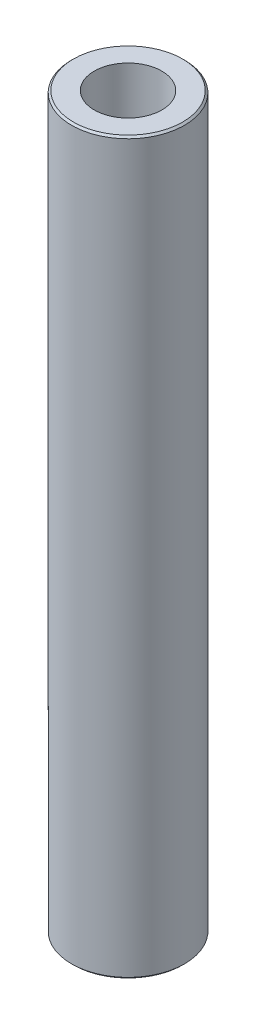
ISO-10303-21;
HEADER;
FILE_DESCRIPTION(('STEP AP214'),'2;1');
FILE_NAME('part.step','',(''),(''),'','','');
FILE_SCHEMA(('AUTOMOTIVE_DESIGN { 1 0 10303 214 1 1 1 1 }'));
ENDSEC;
DATA;
#1=APPLICATION_CONTEXT('core data for automotive mechanical design processes');
#2=APPLICATION_PROTOCOL_DEFINITION('international standard','automotive_design',2000,#1);
#3=PRODUCT_CONTEXT('',#1,'mechanical');
#4=PRODUCT('Part','Part','',(#3));
#5=PRODUCT_RELATED_PRODUCT_CATEGORY('part','',(#4));
#6=PRODUCT_DEFINITION_FORMATION('','',#4);
#7=PRODUCT_DEFINITION_CONTEXT('part definition',#1,'design');
#8=PRODUCT_DEFINITION('design','',#6,#7);
#9=PRODUCT_DEFINITION_SHAPE('','',#8);
#10=(LENGTH_UNIT() NAMED_UNIT(*) SI_UNIT(.MILLI.,.METRE.));
#11=(NAMED_UNIT(*) PLANE_ANGLE_UNIT() SI_UNIT($,.RADIAN.));
#12=(NAMED_UNIT(*) SI_UNIT($,.STERADIAN.) SOLID_ANGLE_UNIT());
#13=UNCERTAINTY_MEASURE_WITH_UNIT(LENGTH_MEASURE(1.E-05),#10,'distance_accuracy_value','');
#14=(GEOMETRIC_REPRESENTATION_CONTEXT(3) GLOBAL_UNCERTAINTY_ASSIGNED_CONTEXT((#13)) GLOBAL_UNIT_ASSIGNED_CONTEXT((#10,
#11,#12)) REPRESENTATION_CONTEXT('',''));
#15=CARTESIAN_POINT('',(0.,0.,0.));
#16=DIRECTION('',(0.,0.,1.));
#17=DIRECTION('',(1.,0.,0.));
#18=AXIS2_PLACEMENT_3D('',#15,#16,#17);
#19=CARTESIAN_POINT('',(0.,484.537605117862,0.));
#20=DIRECTION('',(0.,-1.,0.));
#21=DIRECTION('',(0.,0.,-1.));
#22=AXIS2_PLACEMENT_3D('',#19,#20,#21);
#23=CYLINDRICAL_SURFACE('',#22,37.5);
#24=CARTESIAN_POINT('',(0.,483.301031450431,0.));
#25=DIRECTION('',(0.,1.,0.));
#26=DIRECTION('',(0.,0.,1.));
#27=AXIS2_PLACEMENT_3D('',#24,#25,#26);
#28=CIRCLE('',#27,37.5);
#29=CARTESIAN_POINT('',(0.,483.301031450431,-37.5));
#30=VERTEX_POINT('',#29);
#31=EDGE_CURVE('E50',#30,#30,#28,.F.);
#32=CARTESIAN_POINT('',(0.,1.23657366743141,0.));
#33=DIRECTION('',(0.,1.,0.));
#34=DIRECTION('',(0.,0.,1.));
#35=AXIS2_PLACEMENT_3D('',#32,#33,#34);
#36=CIRCLE('',#35,37.5);
#37=CARTESIAN_POINT('',(0.,1.23657366743135,-37.5));
#38=VERTEX_POINT('',#37);
#39=EDGE_CURVE('E51',#38,#38,#36,.T.);
#40=CARTESIAN_POINT('',(0.,483.301031450431,-37.5));
#41=CARTESIAN_POINT('',(0.,478.279526681858,-37.5));
#42=CARTESIAN_POINT('',(0.,473.258021913286,-37.5));
#43=CARTESIAN_POINT('',(0.,463.21501237614,-37.5));
#44=CARTESIAN_POINT('',(0.,458.193507607567,-37.5));
#45=CARTESIAN_POINT('',(0.,448.150498070421,-37.5));
#46=CARTESIAN_POINT('',(0.,443.128993301848,-37.5));
#47=CARTESIAN_POINT('',(0.,433.085983764702,-37.5));
#48=CARTESIAN_POINT('',(0.,428.064478996129,-37.5));
#49=CARTESIAN_POINT('',(0.,418.021469458984,-37.5));
#50=CARTESIAN_POINT('',(0.,412.999964690411,-37.5));
#51=CARTESIAN_POINT('',(0.,402.956955153265,-37.5));
#52=CARTESIAN_POINT('',(0.,397.935450384692,-37.5));
#53=CARTESIAN_POINT('',(0.,387.892440847546,-37.5));
#54=CARTESIAN_POINT('',(0.,382.870936078973,-37.5));
#55=CARTESIAN_POINT('',(0.,372.827926541827,-37.5));
#56=CARTESIAN_POINT('',(0.,367.806421773254,-37.5));
#57=CARTESIAN_POINT('',(0.,357.763412236108,-37.5));
#58=CARTESIAN_POINT('',(0.,352.741907467536,-37.5));
#59=CARTESIAN_POINT('',(0.,342.69889793039,-37.5));
#60=CARTESIAN_POINT('',(0.,337.677393161817,-37.5));
#61=CARTESIAN_POINT('',(0.,327.634383624671,-37.5));
#62=CARTESIAN_POINT('',(0.,322.612878856098,-37.5));
#63=CARTESIAN_POINT('',(0.,312.569869318952,-37.5));
#64=CARTESIAN_POINT('',(0.,307.548364550379,-37.5));
#65=CARTESIAN_POINT('',(0.,297.505355013233,-37.5));
#66=CARTESIAN_POINT('',(0.,292.483850244661,-37.5));
#67=CARTESIAN_POINT('',(0.,282.440840707515,-37.5));
#68=CARTESIAN_POINT('',(0.,277.419335938942,-37.5));
#69=CARTESIAN_POINT('',(0.,267.376326401796,-37.5));
#70=CARTESIAN_POINT('',(0.,262.354821633223,-37.5));
#71=CARTESIAN_POINT('',(0.,252.311812096077,-37.5));
#72=CARTESIAN_POINT('',(0.,247.290307327504,-37.5));
#73=CARTESIAN_POINT('',(0.,237.247297790358,-37.5));
#74=CARTESIAN_POINT('',(0.,232.225793021786,-37.5));
#75=CARTESIAN_POINT('',(0.,222.18278348464,-37.5));
#76=CARTESIAN_POINT('',(0.,217.161278716067,-37.5));
#77=CARTESIAN_POINT('',(0.,207.118269178921,-37.5));
#78=CARTESIAN_POINT('',(0.,202.096764410348,-37.5));
#79=CARTESIAN_POINT('',(0.,192.053754873202,-37.5));
#80=CARTESIAN_POINT('',(0.,187.032250104629,-37.5));
#81=CARTESIAN_POINT('',(0.,176.989240567483,-37.5));
#82=CARTESIAN_POINT('',(0.,171.967735798911,-37.5));
#83=CARTESIAN_POINT('',(0.,161.924726261765,-37.5));
#84=CARTESIAN_POINT('',(0.,156.903221493192,-37.5));
#85=CARTESIAN_POINT('',(0.,146.860211956046,-37.5));
#86=CARTESIAN_POINT('',(0.,141.838707187473,-37.5));
#87=CARTESIAN_POINT('',(0.,131.795697650327,-37.5));
#88=CARTESIAN_POINT('',(0.,126.774192881754,-37.5));
#89=CARTESIAN_POINT('',(0.,116.731183344608,-37.5));
#90=CARTESIAN_POINT('',(0.,111.709678576036,-37.5));
#91=CARTESIAN_POINT('',(0.,101.66666903889,-37.5));
#92=CARTESIAN_POINT('',(0.,96.6451642703168,-37.5));
#93=CARTESIAN_POINT('',(0.,86.602154733171,-37.5));
#94=CARTESIAN_POINT('',(0.,81.5806499645981,-37.5));
#95=CARTESIAN_POINT('',(0.,71.5376404274522,-37.5));
#96=CARTESIAN_POINT('',(0.,66.5161356588793,-37.5));
#97=CARTESIAN_POINT('',(0.,56.4731261217335,-37.5));
#98=CARTESIAN_POINT('',(0.,51.4516213531605,-37.5));
#99=CARTESIAN_POINT('',(0.,41.4086118160147,-37.5));
#100=CARTESIAN_POINT('',(0.,36.3871070474418,-37.5));
#101=CARTESIAN_POINT('',(0.,26.3440975102959,-37.5));
#102=CARTESIAN_POINT('',(0.,21.322592741723,-37.5));
#103=CARTESIAN_POINT('',(0.,11.2795832045772,-37.5));
#104=CARTESIAN_POINT('',(0.,6.25807843600427,-37.5));
#105=CARTESIAN_POINT('',(0.,1.23657366743135,-37.5));
#106=B_SPLINE_CURVE_WITH_KNOTS('',3,(#40,#41,#42,#43,#44,#45,#46,#47,#48,#49,#50,#51,#52,#53,
#54,#55,#56,#57,#58,#59,#60,#61,#62,#63,#64,#65,#66,#67,#68,#69,#70,#71,#72,#73,#74,#75,#76,#77,
#78,#79,#80,#81,#82,#83,#84,#85,#86,#87,#88,#89,#90,#91,#92,#93,#94,#95,#96,#97,#98,#99,#100,
#101,#102,#103,#104,#105),.UNSPECIFIED.,.F.,.F.,(4,2,2,2,2,2,2,2,2,2,2,2,2,2,2,2,2,2,2,2,2,2,2,
2,2,2,2,2,2,2,2,2,4),(0.,15.0645143057187,30.1290286114375,45.1935429171562,60.258057222875,
75.3225715285937,90.3870858343125,105.451600140031,120.51611444575,135.580628751469,
150.645143057188,165.709657362906,180.774171668625,195.838685974344,210.903200280062,
225.967714585781,241.0322288915,256.096743197219,271.161257502938,286.225771808656,
301.290286114375,316.354800420094,331.419314725813,346.483829031531,361.54834333725,
376.612857642969,391.677371948687,406.741886254406,421.806400560125,436.870914865844,
451.935429171563,466.999943477281,482.064457783),.UNSPECIFIED.);
#107=EDGE_CURVE('BSEAM39',#30,#38,#106,.T.);
#108=ORIENTED_EDGE('',*,*,#31,.T.);
#109=ORIENTED_EDGE('',*,*,#39,.T.);
#110=ORIENTED_EDGE('',*,*,#107,.T.);
#111=ORIENTED_EDGE('',*,*,#107,.F.);
#112=EDGE_LOOP('',(#108,#110,#109,#111));
#113=FACE_BOUND('',#112,.T.);
#114=ADVANCED_FACE('F39',(#113),#23,.T.);
#115=CARTESIAN_POINT('',(0.,484.537605117862,0.));
#116=DIRECTION('',(0.,1.,0.));
#117=DIRECTION('',(0.,0.,1.));
#118=AXIS2_PLACEMENT_3D('',#115,#116,#117);
#119=PLANE('',#118);
#120=CARTESIAN_POINT('',(0.,484.537605117862,0.));
#121=DIRECTION('',(0.,1.,0.));
#122=DIRECTION('',(0.,0.,1.));
#123=AXIS2_PLACEMENT_3D('',#120,#121,#122);
#124=CIRCLE('',#123,36.2634263325691);
#125=CARTESIAN_POINT('',(0.,484.537605117862,36.2634263325691));
#126=VERTEX_POINT('',#125);
#127=EDGE_CURVE('E54',#126,#126,#124,.T.);
#128=ORIENTED_EDGE('',*,*,#127,.T.);
#129=EDGE_LOOP('',(#128));
#130=FACE_BOUND('',#129,.T.);
#131=CARTESIAN_POINT('',(0.,484.537605117862,0.));
#132=DIRECTION('',(0.,1.,0.));
#133=DIRECTION('',(0.,0.,1.));
#134=AXIS2_PLACEMENT_3D('',#131,#132,#133);
#135=CIRCLE('',#134,22.4098353996478);
#136=CARTESIAN_POINT('',(0.,484.537605117862,-22.4098353996478));
#137=VERTEX_POINT('',#136);
#138=EDGE_CURVE('E58',#137,#137,#135,.T.);
#139=ORIENTED_EDGE('',*,*,#138,.F.);
#140=EDGE_LOOP('',(#139));
#141=FACE_BOUND('',#140,.T.);
#142=ADVANCED_FACE('F69',(#130,#141),#119,.T.);
#143=CARTESIAN_POINT('',(0.,0.,0.));
#144=DIRECTION('',(0.,1.,0.));
#145=DIRECTION('',(0.,0.,1.));
#146=AXIS2_PLACEMENT_3D('',#143,#144,#145);
#147=PLANE('',#146);
#148=CARTESIAN_POINT('',(0.,0.,0.));
#149=DIRECTION('',(0.,1.,0.));
#150=DIRECTION('',(0.,0.,1.));
#151=AXIS2_PLACEMENT_3D('',#148,#149,#150);
#152=CIRCLE('',#151,36.2634263325686);
#153=CARTESIAN_POINT('',(0.,0.,36.2634263325686));
#154=VERTEX_POINT('',#153);
#155=EDGE_CURVE('E10',#154,#154,#152,.F.);
#156=ORIENTED_EDGE('',*,*,#155,.T.);
#157=EDGE_LOOP('',(#156));
#158=FACE_BOUND('',#157,.T.);
#159=CARTESIAN_POINT('',(0.,0.,0.));
#160=DIRECTION('',(0.,1.,0.));
#161=DIRECTION('',(0.,0.,1.));
#162=AXIS2_PLACEMENT_3D('',#159,#160,#161);
#163=CIRCLE('',#162,22.4098353996478);
#164=CARTESIAN_POINT('',(0.,0.,-22.4098353996478));
#165=VERTEX_POINT('',#164);
#166=EDGE_CURVE('E63',#165,#165,#163,.T.);
#167=ORIENTED_EDGE('',*,*,#166,.T.);
#168=EDGE_LOOP('',(#167));
#169=FACE_BOUND('',#168,.T.);
#170=ADVANCED_FACE('F75',(#158,#169),#147,.F.);
#171=CARTESIAN_POINT('',(0.,484.537605117862,0.));
#172=DIRECTION('',(0.,-1.,0.));
#173=DIRECTION('',(0.,0.,-1.));
#174=AXIS2_PLACEMENT_3D('',#171,#172,#173);
#175=CYLINDRICAL_SURFACE('',#174,22.4098353996478);
#176=CARTESIAN_POINT('',(0.,484.537605117862,-22.4098353996478));
#177=CARTESIAN_POINT('',(0.,479.490338397885,-22.4098353996478));
#178=CARTESIAN_POINT('',(0.,474.443071677907,-22.4098353996478));
#179=CARTESIAN_POINT('',(0.,464.348538237951,-22.4098353996478));
#180=CARTESIAN_POINT('',(0.,459.301271517974,-22.4098353996478));
#181=CARTESIAN_POINT('',(0.,449.206738078018,-22.4098353996478));
#182=CARTESIAN_POINT('',(0.,444.15947135804,-22.4098353996478));
#183=CARTESIAN_POINT('',(0.,434.064937918085,-22.4098353996478));
#184=CARTESIAN_POINT('',(0.,429.017671198107,-22.4098353996478));
#185=CARTESIAN_POINT('',(0.,418.923137758152,-22.4098353996478));
#186=CARTESIAN_POINT('',(0.,413.875871038174,-22.4098353996478));
#187=CARTESIAN_POINT('',(0.,403.781337598219,-22.4098353996478));
#188=CARTESIAN_POINT('',(0.,398.734070878241,-22.4098353996478));
#189=CARTESIAN_POINT('',(0.,388.639537438285,-22.4098353996478));
#190=CARTESIAN_POINT('',(0.,383.592270718308,-22.4098353996478));
#191=CARTESIAN_POINT('',(0.,373.497737278352,-22.4098353996478));
#192=CARTESIAN_POINT('',(0.,368.450470558374,-22.4098353996478));
#193=CARTESIAN_POINT('',(0.,358.355937118419,-22.4098353996478));
#194=CARTESIAN_POINT('',(0.,353.308670398441,-22.4098353996478));
#195=CARTESIAN_POINT('',(0.,343.214136958486,-22.4098353996478));
#196=CARTESIAN_POINT('',(0.,338.166870238508,-22.4098353996478));
#197=CARTESIAN_POINT('',(0.,328.072336798553,-22.4098353996478));
#198=CARTESIAN_POINT('',(0.,323.025070078575,-22.4098353996478));
#199=CARTESIAN_POINT('',(0.,312.930536638619,-22.4098353996478));
#200=CARTESIAN_POINT('',(0.,307.883269918642,-22.4098353996478));
#201=CARTESIAN_POINT('',(0.,297.788736478686,-22.4098353996478));
#202=CARTESIAN_POINT('',(0.,292.741469758708,-22.4098353996478));
#203=CARTESIAN_POINT('',(0.,282.646936318753,-22.4098353996478));
#204=CARTESIAN_POINT('',(0.,277.599669598775,-22.4098353996478));
#205=CARTESIAN_POINT('',(0.,267.50513615882,-22.4098353996478));
#206=CARTESIAN_POINT('',(0.,262.457869438842,-22.4098353996478));
#207=CARTESIAN_POINT('',(0.,252.363335998887,-22.4098353996478));
#208=CARTESIAN_POINT('',(0.,247.316069278909,-22.4098353996478));
#209=CARTESIAN_POINT('',(0.,237.221535838953,-22.4098353996478));
#210=CARTESIAN_POINT('',(0.,232.174269118976,-22.4098353996478));
#211=CARTESIAN_POINT('',(0.,222.07973567902,-22.4098353996478));
#212=CARTESIAN_POINT('',(0.,217.032468959043,-22.4098353996478));
#213=CARTESIAN_POINT('',(0.,206.937935519087,-22.4098353996478));
#214=CARTESIAN_POINT('',(0.,201.890668799109,-22.4098353996478));
#215=CARTESIAN_POINT('',(0.,191.796135359154,-22.4098353996478));
#216=CARTESIAN_POINT('',(0.,186.748868639176,-22.4098353996478));
#217=CARTESIAN_POINT('',(0.,176.654335199221,-22.4098353996478));
#218=CARTESIAN_POINT('',(0.,171.607068479243,-22.4098353996478));
#219=CARTESIAN_POINT('',(0.,161.512535039287,-22.4098353996478));
#220=CARTESIAN_POINT('',(0.,156.46526831931,-22.4098353996478));
#221=CARTESIAN_POINT('',(0.,146.370734879354,-22.4098353996478));
#222=CARTESIAN_POINT('',(0.,141.323468159377,-22.4098353996478));
#223=CARTESIAN_POINT('',(0.,131.228934719421,-22.4098353996478));
#224=CARTESIAN_POINT('',(0.,126.181667999443,-22.4098353996478));
#225=CARTESIAN_POINT('',(0.,116.087134559488,-22.4098353996478));
#226=CARTESIAN_POINT('',(0.,111.03986783951,-22.4098353996478));
#227=CARTESIAN_POINT('',(0.,100.945334399555,-22.4098353996478));
#228=CARTESIAN_POINT('',(0.,95.8980676795769,-22.4098353996478));
#229=CARTESIAN_POINT('',(0.,85.8035342396214,-22.4098353996478));
#230=CARTESIAN_POINT('',(0.,80.7562675196437,-22.4098353996478));
#231=CARTESIAN_POINT('',(0.,70.6617340796882,-22.4098353996478));
#232=CARTESIAN_POINT('',(0.,65.6144673597105,-22.4098353996478));
#233=CARTESIAN_POINT('',(0.,55.5199339197551,-22.4098353996478));
#234=CARTESIAN_POINT('',(0.,50.4726671997773,-22.4098353996478));
#235=CARTESIAN_POINT('',(0.,40.3781337598219,-22.4098353996478));
#236=CARTESIAN_POINT('',(0.,35.3308670398441,-22.4098353996478));
#237=CARTESIAN_POINT('',(0.,25.2363335998887,-22.4098353996478));
#238=CARTESIAN_POINT('',(0.,20.1890668799109,-22.4098353996478));
#239=CARTESIAN_POINT('',(0.,10.0945334399555,-22.4098353996478));
#240=CARTESIAN_POINT('',(0.,5.04726671997773,-22.4098353996478));
#241=CARTESIAN_POINT('',(0.,0.,-22.4098353996478));
#242=B_SPLINE_CURVE_WITH_KNOTS('',3,(#176,#177,#178,#179,#180,#181,#182,#183,#184,#185,#186,
#187,#188,#189,#190,#191,#192,#193,#194,#195,#196,#197,#198,#199,#200,#201,#202,#203,#204,#205,
#206,#207,#208,#209,#210,#211,#212,#213,#214,#215,#216,#217,#218,#219,#220,#221,#222,#223,#224,
#225,#226,#227,#228,#229,#230,#231,#232,#233,#234,#235,#236,#237,#238,#239,#240,#241),
.UNSPECIFIED.,.F.,.F.,(4,2,2,2,2,2,2,2,2,2,2,2,2,2,2,2,2,2,2,2,2,2,2,2,2,2,2,2,2,2,2,2,4),(0.,
15.1418001599332,30.2836003198664,45.4254004797996,60.5672006397328,75.709000799666,
90.8508009595992,105.992601119532,121.134401279466,136.276201439399,151.418001599332,
166.559801759265,181.701601919198,196.843402079132,211.985202239065,227.127002398998,
242.268802558931,257.410602718864,272.552402878798,287.694203038731,302.836003198664,
317.977803358597,333.11960351853,348.261403678464,363.403203838397,378.54500399833,
393.686804158263,408.828604318196,423.97040447813,439.112204638063,454.254004797996,
469.395804957929,484.537605117862),.UNSPECIFIED.);
#243=EDGE_CURVE('BSEAM70',#137,#165,#242,.T.);
#244=ORIENTED_EDGE('',*,*,#138,.T.);
#245=ORIENTED_EDGE('',*,*,#166,.F.);
#246=ORIENTED_EDGE('',*,*,#243,.T.);
#247=ORIENTED_EDGE('',*,*,#243,.F.);
#248=EDGE_LOOP('',(#244,#246,#245,#247));
#249=FACE_BOUND('',#248,.T.);
#250=ADVANCED_FACE('F70',(#249),#175,.F.);
#251=CARTESIAN_POINT('',(0.,484.537605117862,0.));
#252=DIRECTION('',(0.,-1.,0.));
#253=DIRECTION('',(0.,0.,-1.));
#254=AXIS2_PLACEMENT_3D('',#251,#252,#253);
#255=CONICAL_SURFACE('',#254,36.2634263325691,0.785398163397485);
#256=ORIENTED_EDGE('',*,*,#31,.F.);
#257=EDGE_LOOP('',(#256));
#258=FACE_BOUND('',#257,.T.);
#259=ORIENTED_EDGE('',*,*,#127,.F.);
#260=EDGE_LOOP('',(#259));
#261=FACE_BOUND('',#260,.T.);
#262=ADVANCED_FACE('F81',(#258,#261),#255,.T.);
#263=CARTESIAN_POINT('',(0.,1.23657366743141,0.));
#264=DIRECTION('',(0.,1.,0.));
#265=DIRECTION('',(0.,0.,1.));
#266=AXIS2_PLACEMENT_3D('',#263,#264,#265);
#267=CONICAL_SURFACE('',#266,37.5,0.78539816339744);
#268=ORIENTED_EDGE('',*,*,#155,.F.);
#269=EDGE_LOOP('',(#268));
#270=FACE_BOUND('',#269,.T.);
#271=ORIENTED_EDGE('',*,*,#39,.F.);
#272=EDGE_LOOP('',(#271));
#273=FACE_BOUND('',#272,.T.);
#274=ADVANCED_FACE('F45',(#270,#273),#267,.T.);
#275=CLOSED_SHELL('',(#114,#142,#170,#250,#262,#274));
#276=MANIFOLD_SOLID_BREP('B2',#275);
#277=ADVANCED_BREP_SHAPE_REPRESENTATION('',(#18,#276),#14);
#278=SHAPE_DEFINITION_REPRESENTATION(#9,#277);
ENDSEC;
END-ISO-10303-21;
